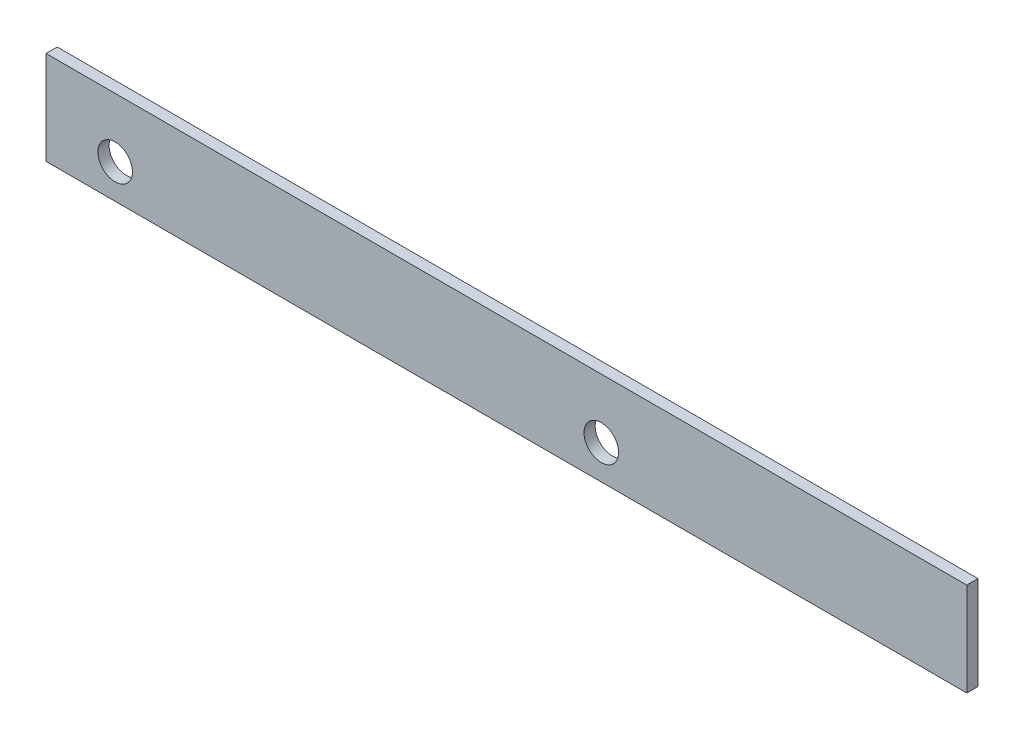
ISO-10303-21;
HEADER;
FILE_DESCRIPTION(('STEP AP214'),'2;1');
FILE_NAME('part.step','',(''),(''),'','','');
FILE_SCHEMA(('AUTOMOTIVE_DESIGN { 1 0 10303 214 1 1 1 1 }'));
ENDSEC;
DATA;
#1=APPLICATION_CONTEXT('core data for automotive mechanical design processes');
#2=APPLICATION_PROTOCOL_DEFINITION('international standard','automotive_design',2000,#1);
#3=PRODUCT_CONTEXT('',#1,'mechanical');
#4=PRODUCT('Part','Part','',(#3));
#5=PRODUCT_RELATED_PRODUCT_CATEGORY('part','',(#4));
#6=PRODUCT_DEFINITION_FORMATION('','',#4);
#7=PRODUCT_DEFINITION_CONTEXT('part definition',#1,'design');
#8=PRODUCT_DEFINITION('design','',#6,#7);
#9=PRODUCT_DEFINITION_SHAPE('','',#8);
#10=(LENGTH_UNIT() NAMED_UNIT(*) SI_UNIT(.MILLI.,.METRE.));
#11=(NAMED_UNIT(*) PLANE_ANGLE_UNIT() SI_UNIT($,.RADIAN.));
#12=(NAMED_UNIT(*) SI_UNIT($,.STERADIAN.) SOLID_ANGLE_UNIT());
#13=UNCERTAINTY_MEASURE_WITH_UNIT(LENGTH_MEASURE(1.E-05),#10,'distance_accuracy_value','');
#14=(GEOMETRIC_REPRESENTATION_CONTEXT(3) GLOBAL_UNCERTAINTY_ASSIGNED_CONTEXT((#13)) GLOBAL_UNIT_ASSIGNED_CONTEXT((#10,
#11,#12)) REPRESENTATION_CONTEXT('',''));
#15=CARTESIAN_POINT('',(0.,0.,0.));
#16=DIRECTION('',(0.,0.,1.));
#17=DIRECTION('',(1.,0.,0.));
#18=AXIS2_PLACEMENT_3D('',#15,#16,#17);
#19=CARTESIAN_POINT('',(985.,0.,12.));
#20=DIRECTION('',(0.,1.,0.));
#21=DIRECTION('',(0.,0.,1.));
#22=AXIS2_PLACEMENT_3D('',#19,#20,#21);
#23=PLANE('',#22);
#24=DIRECTION('',(1.,0.,0.));
#25=VECTOR('',#24,1.);
#26=CARTESIAN_POINT('',(985.,0.,0.));
#27=LINE('',#26,#25);
#28=CARTESIAN_POINT('',(0.,0.,0.));
#29=VERTEX_POINT('',#28);
#30=CARTESIAN_POINT('',(985.,0.,0.));
#31=VERTEX_POINT('',#30);
#32=EDGE_CURVE('E102',#29,#31,#27,.T.);
#33=ORIENTED_EDGE('',*,*,#32,.T.);
#34=DIRECTION('',(0.,0.,-1.));
#35=VECTOR('',#34,1.);
#36=CARTESIAN_POINT('',(985.,0.,12.));
#37=LINE('',#36,#35);
#38=CARTESIAN_POINT('',(985.,0.,12.));
#39=VERTEX_POINT('',#38);
#40=EDGE_CURVE('E11',#39,#31,#37,.T.);
#41=ORIENTED_EDGE('',*,*,#40,.F.);
#42=DIRECTION('',(1.,0.,0.));
#43=VECTOR('',#42,1.);
#44=CARTESIAN_POINT('',(985.,0.,12.));
#45=LINE('',#44,#43);
#46=CARTESIAN_POINT('',(0.,0.,12.));
#47=VERTEX_POINT('',#46);
#48=EDGE_CURVE('E90',#47,#39,#45,.T.);
#49=ORIENTED_EDGE('',*,*,#48,.F.);
#50=DIRECTION('',(0.,0.,-1.));
#51=VECTOR('',#50,1.);
#52=CARTESIAN_POINT('',(0.,0.,12.));
#53=LINE('',#52,#51);
#54=EDGE_CURVE('E98',#47,#29,#53,.T.);
#55=ORIENTED_EDGE('',*,*,#54,.T.);
#56=EDGE_LOOP('',(#33,#41,#49,#55));
#57=FACE_BOUND('',#56,.T.);
#58=ADVANCED_FACE('F39',(#57),#23,.F.);
#59=CARTESIAN_POINT('',(985.,100.,12.));
#60=DIRECTION('',(-1.,0.,0.));
#61=DIRECTION('',(0.,-1.,0.));
#62=AXIS2_PLACEMENT_3D('',#59,#60,#61);
#63=PLANE('',#62);
#64=DIRECTION('',(0.,1.,0.));
#65=VECTOR('',#64,1.);
#66=CARTESIAN_POINT('',(985.,100.,0.));
#67=LINE('',#66,#65);
#68=CARTESIAN_POINT('',(985.,100.,0.));
#69=VERTEX_POINT('',#68);
#70=EDGE_CURVE('E94',#31,#69,#67,.T.);
#71=ORIENTED_EDGE('',*,*,#70,.T.);
#72=DIRECTION('',(0.,0.,-1.));
#73=VECTOR('',#72,1.);
#74=CARTESIAN_POINT('',(985.,100.,12.));
#75=LINE('',#74,#73);
#76=CARTESIAN_POINT('',(985.,100.,12.));
#77=VERTEX_POINT('',#76);
#78=EDGE_CURVE('E47',#77,#69,#75,.T.);
#79=ORIENTED_EDGE('',*,*,#78,.F.);
#80=DIRECTION('',(0.,1.,0.));
#81=VECTOR('',#80,1.);
#82=CARTESIAN_POINT('',(985.,100.,12.));
#83=LINE('',#82,#81);
#84=EDGE_CURVE('E85',#39,#77,#83,.T.);
#85=ORIENTED_EDGE('',*,*,#84,.F.);
#86=ORIENTED_EDGE('',*,*,#40,.T.);
#87=EDGE_LOOP('',(#71,#79,#85,#86));
#88=FACE_BOUND('',#87,.T.);
#89=ADVANCED_FACE('F93',(#88),#63,.F.);
#90=CARTESIAN_POINT('',(0.,100.,12.));
#91=DIRECTION('',(0.,-1.,0.));
#92=DIRECTION('',(0.,0.,-1.));
#93=AXIS2_PLACEMENT_3D('',#90,#91,#92);
#94=PLANE('',#93);
#95=DIRECTION('',(-1.,0.,0.));
#96=VECTOR('',#95,1.);
#97=CARTESIAN_POINT('',(0.,100.,0.));
#98=LINE('',#97,#96);
#99=CARTESIAN_POINT('',(0.,100.,0.));
#100=VERTEX_POINT('',#99);
#101=EDGE_CURVE('E72',#69,#100,#98,.T.);
#102=ORIENTED_EDGE('',*,*,#101,.T.);
#103=DIRECTION('',(0.,0.,-1.));
#104=VECTOR('',#103,1.);
#105=CARTESIAN_POINT('',(0.,100.,12.));
#106=LINE('',#105,#104);
#107=CARTESIAN_POINT('',(0.,100.,12.));
#108=VERTEX_POINT('',#107);
#109=EDGE_CURVE('E95',#108,#100,#106,.T.);
#110=ORIENTED_EDGE('',*,*,#109,.F.);
#111=DIRECTION('',(-1.,0.,0.));
#112=VECTOR('',#111,1.);
#113=CARTESIAN_POINT('',(0.,100.,12.));
#114=LINE('',#113,#112);
#115=EDGE_CURVE('E88',#77,#108,#114,.T.);
#116=ORIENTED_EDGE('',*,*,#115,.F.);
#117=ORIENTED_EDGE('',*,*,#78,.T.);
#118=EDGE_LOOP('',(#102,#110,#116,#117));
#119=FACE_BOUND('',#118,.T.);
#120=ADVANCED_FACE('F96',(#119),#94,.F.);
#121=CARTESIAN_POINT('',(0.,0.,12.));
#122=DIRECTION('',(1.,0.,0.));
#123=DIRECTION('',(0.,0.,-1.));
#124=AXIS2_PLACEMENT_3D('',#121,#122,#123);
#125=PLANE('',#124);
#126=DIRECTION('',(0.,-1.,0.));
#127=VECTOR('',#126,1.);
#128=CARTESIAN_POINT('',(0.,0.,0.));
#129=LINE('',#128,#127);
#130=EDGE_CURVE('E78',#100,#29,#129,.T.);
#131=ORIENTED_EDGE('',*,*,#130,.T.);
#132=ORIENTED_EDGE('',*,*,#54,.F.);
#133=DIRECTION('',(0.,-1.,0.));
#134=VECTOR('',#133,1.);
#135=CARTESIAN_POINT('',(0.,0.,12.));
#136=LINE('',#135,#134);
#137=EDGE_CURVE('E55',#108,#47,#136,.T.);
#138=ORIENTED_EDGE('',*,*,#137,.F.);
#139=ORIENTED_EDGE('',*,*,#109,.T.);
#140=EDGE_LOOP('',(#131,#132,#138,#139));
#141=FACE_BOUND('',#140,.T.);
#142=ADVANCED_FACE('F110',(#141),#125,.F.);
#143=CARTESIAN_POINT('',(0.,0.,12.));
#144=DIRECTION('',(0.,0.,-1.));
#145=DIRECTION('',(-1.,0.,0.));
#146=AXIS2_PLACEMENT_3D('',#143,#144,#145);
#147=PLANE('',#146);
#148=CARTESIAN_POINT('',(594.,36.5,12.));
#149=DIRECTION('',(0.,0.,1.));
#150=DIRECTION('',(1.,0.,0.));
#151=AXIS2_PLACEMENT_3D('',#148,#149,#150);
#152=CIRCLE('',#151,18.5);
#153=CARTESIAN_POINT('',(612.5,36.5,12.));
#154=VERTEX_POINT('',#153);
#155=EDGE_CURVE('E122',#154,#154,#152,.T.);
#156=ORIENTED_EDGE('',*,*,#155,.F.);
#157=EDGE_LOOP('',(#156));
#158=FACE_BOUND('',#157,.T.);
#159=CARTESIAN_POINT('',(74.,36.5,12.));
#160=DIRECTION('',(0.,0.,-1.));
#161=DIRECTION('',(-1.,0.,0.));
#162=AXIS2_PLACEMENT_3D('',#159,#160,#161);
#163=CIRCLE('',#162,18.5);
#164=CARTESIAN_POINT('',(55.5,36.5,12.));
#165=VERTEX_POINT('',#164);
#166=EDGE_CURVE('E105',#165,#165,#163,.T.);
#167=ORIENTED_EDGE('',*,*,#166,.T.);
#168=EDGE_LOOP('',(#167));
#169=FACE_BOUND('',#168,.T.);
#170=ORIENTED_EDGE('',*,*,#48,.T.);
#171=ORIENTED_EDGE('',*,*,#84,.T.);
#172=ORIENTED_EDGE('',*,*,#115,.T.);
#173=ORIENTED_EDGE('',*,*,#137,.T.);
#174=EDGE_LOOP('',(#170,#171,#172,#173));
#175=FACE_BOUND('',#174,.T.);
#176=ADVANCED_FACE('F86',(#158,#169,#175),#147,.F.);
#177=CARTESIAN_POINT('',(0.,0.,0.));
#178=DIRECTION('',(0.,0.,-1.));
#179=DIRECTION('',(-1.,0.,0.));
#180=AXIS2_PLACEMENT_3D('',#177,#178,#179);
#181=PLANE('',#180);
#182=CARTESIAN_POINT('',(594.,36.5,0.));
#183=DIRECTION('',(0.,0.,1.));
#184=DIRECTION('',(1.,0.,0.));
#185=AXIS2_PLACEMENT_3D('',#182,#183,#184);
#186=CIRCLE('',#185,18.5);
#187=CARTESIAN_POINT('',(612.5,36.5,0.));
#188=VERTEX_POINT('',#187);
#189=EDGE_CURVE('E121',#188,#188,#186,.T.);
#190=ORIENTED_EDGE('',*,*,#189,.T.);
#191=EDGE_LOOP('',(#190));
#192=FACE_BOUND('',#191,.T.);
#193=CARTESIAN_POINT('',(74.,36.5,0.));
#194=DIRECTION('',(0.,0.,1.));
#195=DIRECTION('',(1.,0.,0.));
#196=AXIS2_PLACEMENT_3D('',#193,#194,#195);
#197=CIRCLE('',#196,18.5);
#198=CARTESIAN_POINT('',(92.5,36.5,0.));
#199=VERTEX_POINT('',#198);
#200=EDGE_CURVE('E118',#199,#199,#197,.T.);
#201=ORIENTED_EDGE('',*,*,#200,.T.);
#202=EDGE_LOOP('',(#201));
#203=FACE_BOUND('',#202,.T.);
#204=ORIENTED_EDGE('',*,*,#32,.F.);
#205=ORIENTED_EDGE('',*,*,#130,.F.);
#206=ORIENTED_EDGE('',*,*,#101,.F.);
#207=ORIENTED_EDGE('',*,*,#70,.F.);
#208=EDGE_LOOP('',(#204,#205,#206,#207));
#209=FACE_BOUND('',#208,.T.);
#210=ADVANCED_FACE('F113',(#192,#203,#209),#181,.T.);
#211=CARTESIAN_POINT('',(74.,36.5,0.));
#212=DIRECTION('',(0.,0.,1.));
#213=DIRECTION('',(1.,0.,0.));
#214=AXIS2_PLACEMENT_3D('',#211,#212,#213);
#215=CYLINDRICAL_SURFACE('',#214,18.5);
#216=ORIENTED_EDGE('',*,*,#200,.F.);
#217=EDGE_LOOP('',(#216));
#218=FACE_BOUND('',#217,.T.);
#219=ORIENTED_EDGE('',*,*,#166,.F.);
#220=EDGE_LOOP('',(#219));
#221=FACE_BOUND('',#220,.T.);
#222=ADVANCED_FACE('F133',(#218,#221),#215,.F.);
#223=CARTESIAN_POINT('',(594.,36.5,0.));
#224=DIRECTION('',(0.,0.,1.));
#225=DIRECTION('',(1.,0.,0.));
#226=AXIS2_PLACEMENT_3D('',#223,#224,#225);
#227=CYLINDRICAL_SURFACE('',#226,18.5);
#228=ORIENTED_EDGE('',*,*,#189,.F.);
#229=EDGE_LOOP('',(#228));
#230=FACE_BOUND('',#229,.T.);
#231=ORIENTED_EDGE('',*,*,#155,.T.);
#232=EDGE_LOOP('',(#231));
#233=FACE_BOUND('',#232,.T.);
#234=ADVANCED_FACE('F130',(#230,#233),#227,.F.);
#235=CLOSED_SHELL('',(#58,#89,#120,#142,#176,#210,#222,#234));
#236=MANIFOLD_SOLID_BREP('B2',#235);
#237=ADVANCED_BREP_SHAPE_REPRESENTATION('',(#18,#236),#14);
#238=SHAPE_DEFINITION_REPRESENTATION(#9,#237);
ENDSEC;
END-ISO-10303-21;
